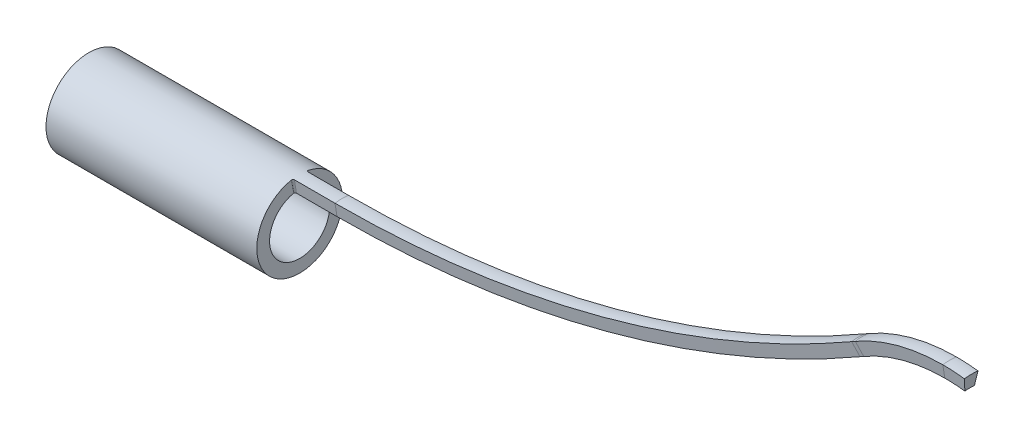
ISO-10303-21;
HEADER;
FILE_DESCRIPTION(('STEP AP214'),'2;1');
FILE_NAME('part.step','',(''),(''),'','','');
FILE_SCHEMA(('AUTOMOTIVE_DESIGN { 1 0 10303 214 1 1 1 1 }'));
ENDSEC;
DATA;
#1=APPLICATION_CONTEXT('core data for automotive mechanical design processes');
#2=APPLICATION_PROTOCOL_DEFINITION('international standard','automotive_design',2000,#1);
#3=PRODUCT_CONTEXT('',#1,'mechanical');
#4=PRODUCT('Part','Part','',(#3));
#5=PRODUCT_RELATED_PRODUCT_CATEGORY('part','',(#4));
#6=PRODUCT_DEFINITION_FORMATION('','',#4);
#7=PRODUCT_DEFINITION_CONTEXT('part definition',#1,'design');
#8=PRODUCT_DEFINITION('design','',#6,#7);
#9=PRODUCT_DEFINITION_SHAPE('','',#8);
#10=(LENGTH_UNIT() NAMED_UNIT(*) SI_UNIT(.MILLI.,.METRE.));
#11=(NAMED_UNIT(*) PLANE_ANGLE_UNIT() SI_UNIT($,.RADIAN.));
#12=(NAMED_UNIT(*) SI_UNIT($,.STERADIAN.) SOLID_ANGLE_UNIT());
#13=UNCERTAINTY_MEASURE_WITH_UNIT(LENGTH_MEASURE(1.E-05),#10,'distance_accuracy_value','');
#14=(GEOMETRIC_REPRESENTATION_CONTEXT(3) GLOBAL_UNCERTAINTY_ASSIGNED_CONTEXT((#13)) GLOBAL_UNIT_ASSIGNED_CONTEXT((#10,
#11,#12)) REPRESENTATION_CONTEXT('',''));
#15=CARTESIAN_POINT('',(0.,0.,0.));
#16=DIRECTION('',(0.,0.,1.));
#17=DIRECTION('',(1.,0.,0.));
#18=AXIS2_PLACEMENT_3D('',#15,#16,#17);
#19=CARTESIAN_POINT('',(49.,0.,0.));
#20=DIRECTION('',(-1.,0.,0.));
#21=DIRECTION('',(0.,-0.83146961230255,-0.555570233019595));
#22=AXIS2_PLACEMENT_3D('',#19,#20,#21);
#23=CYLINDRICAL_SURFACE('',#22,1.016);
#24=CARTESIAN_POINT('',(0.,0.,0.));
#25=DIRECTION('',(-1.,0.,0.));
#26=DIRECTION('',(0.,-0.92387953251129,-0.382683432365081));
#27=AXIS2_PLACEMENT_3D('',#24,#25,#26);
#28=CIRCLE('',#27,1.016);
#29=CARTESIAN_POINT('',(0.,-0.938661605031471,-0.388806367282923));
#30=VERTEX_POINT('',#29);
#31=EDGE_CURVE('E179',#30,#30,#28,.T.);
#32=ORIENTED_EDGE('',*,*,#31,.F.);
#33=EDGE_LOOP('',(#32));
#34=FACE_BOUND('',#33,.T.);
#35=CARTESIAN_POINT('',(4.99999999999999,0.996477844889681,-0.198211767168391));
#36=CARTESIAN_POINT('',(5.00173146233309,1.00082687806446,-0.176347700936244));
#37=CARTESIAN_POINT('',(5.01520552936779,1.00287171036555,-0.162808629501926));
#38=CARTESIAN_POINT('',(5.03749999999998,1.00311339347271,-0.161305672050498));
#39=B_SPLINE_CURVE_WITH_KNOTS('',3,(#35,#36,#37,#38),.UNSPECIFIED.,.F.,.F.,(4,4),(0.,1.),.UNSPECIFIED.);
#40=CARTESIAN_POINT('',(5.,0.996477844889681,-0.198211767168391));
#41=VERTEX_POINT('',#40);
#42=CARTESIAN_POINT('',(5.03749999999998,1.00311339347271,-0.161305672050498));
#43=VERTEX_POINT('',#42);
#44=EDGE_CURVE('E289',#41,#43,#39,.T.);
#45=ORIENTED_EDGE('',*,*,#44,.F.);
#46=CARTESIAN_POINT('',(5.,0.,0.));
#47=DIRECTION('',(1.,0.,0.));
#48=DIRECTION('',(0.,-0.195090322016129,-0.98078528040323));
#49=AXIS2_PLACEMENT_3D('',#46,#47,#48);
#50=CIRCLE('',#49,1.016);
#51=CARTESIAN_POINT('',(5.,0.996477844889683,0.198211767168382));
#52=VERTEX_POINT('',#51);
#53=EDGE_CURVE('E84',#52,#41,#50,.T.);
#54=ORIENTED_EDGE('',*,*,#53,.F.);
#55=CARTESIAN_POINT('',(5.03749999999998,1.00311339347271,0.16130567205049));
#56=CARTESIAN_POINT('',(5.01520552936779,1.00287171036555,0.162808629501918));
#57=CARTESIAN_POINT('',(5.00173146233309,1.00082687806446,0.176347700936236));
#58=CARTESIAN_POINT('',(4.99999999999999,0.996477844889682,0.198211767168383));
#59=B_SPLINE_CURVE_WITH_KNOTS('',3,(#55,#56,#57,#58),.UNSPECIFIED.,.F.,.F.,(4,4),(0.,1.),.UNSPECIFIED.);
#60=CARTESIAN_POINT('',(5.03749999999998,1.00311339347271,0.16130567205049));
#61=VERTEX_POINT('',#60);
#62=EDGE_CURVE('E185',#52,#61,#59,.F.);
#63=ORIENTED_EDGE('',*,*,#62,.T.);
#64=DIRECTION('',(1.,0.,0.));
#65=VECTOR('',#64,1.);
#66=CARTESIAN_POINT('',(5.03749999999998,1.00311339347271,0.161305672050479));
#67=LINE('',#66,#65);
#68=CARTESIAN_POINT('',(6.,1.00311339347271,0.161305672050479));
#69=VERTEX_POINT('',#68);
#70=EDGE_CURVE('E253',#61,#69,#67,.T.);
#71=ORIENTED_EDGE('',*,*,#70,.T.);
#72=CARTESIAN_POINT('',(6.,0.,0.));
#73=DIRECTION('',(-1.,0.,0.));
#74=DIRECTION('',(0.,1.,0.));
#75=AXIS2_PLACEMENT_3D('',#72,#73,#74);
#76=CIRCLE('',#75,1.016);
#77=CARTESIAN_POINT('',(6.,1.00311339347271,-0.161305672050487));
#78=VERTEX_POINT('',#77);
#79=EDGE_CURVE('E271',#69,#78,#76,.T.);
#80=ORIENTED_EDGE('',*,*,#79,.T.);
#81=DIRECTION('',(1.,0.,0.));
#82=VECTOR('',#81,1.);
#83=CARTESIAN_POINT('',(5.03749999999998,1.00311339347271,-0.161305672050487));
#84=LINE('',#83,#82);
#85=EDGE_CURVE('E257',#43,#78,#84,.T.);
#86=ORIENTED_EDGE('',*,*,#85,.F.);
#87=EDGE_LOOP('',(#45,#54,#63,#71,#80,#86));
#88=FACE_BOUND('',#87,.T.);
#89=ADVANCED_FACE('F74',(#34,#88),#23,.T.);
#90=CARTESIAN_POINT('',(49.,0.,0.));
#91=DIRECTION('',(-1.,0.,0.));
#92=DIRECTION('',(0.,-0.83146961230255,-0.555570233019595));
#93=AXIS2_PLACEMENT_3D('',#90,#91,#92);
#94=CYLINDRICAL_SURFACE('',#93,0.71305);
#95=CARTESIAN_POINT('',(0.,0.,0.));
#96=DIRECTION('',(1.,0.,0.));
#97=DIRECTION('',(0.,0.83146961230255,0.555570233019595));
#98=AXIS2_PLACEMENT_3D('',#95,#96,#97);
#99=CIRCLE('',#98,0.71305);
#100=CARTESIAN_POINT('',(0.,0.592879407052334,0.396149354654622));
#101=VERTEX_POINT('',#100);
#102=EDGE_CURVE('E268',#101,#101,#99,.F.);
#103=ORIENTED_EDGE('',*,*,#102,.T.);
#104=EDGE_LOOP('',(#103));
#105=FACE_BOUND('',#104,.T.);
#106=CARTESIAN_POINT('',(5.,0.,0.));
#107=DIRECTION('',(-1.,0.,0.));
#108=DIRECTION('',(0.,0.195090322016129,0.98078528040323));
#109=AXIS2_PLACEMENT_3D('',#106,#107,#108);
#110=CIRCLE('',#109,0.71305);
#111=CARTESIAN_POINT('',(5.,0.699348944191523,-0.139109154113604));
#112=VERTEX_POINT('',#111);
#113=CARTESIAN_POINT('',(5.,0.699348944191524,0.139109154113598));
#114=VERTEX_POINT('',#113);
#115=EDGE_CURVE('E91',#112,#114,#110,.T.);
#116=ORIENTED_EDGE('',*,*,#115,.F.);
#117=CARTESIAN_POINT('',(5.03749999999998,0.70400591064539,-0.113207686472055));
#118=CARTESIAN_POINT('',(5.03413677933053,0.703977045503818,-0.113380133199832));
#119=CARTESIAN_POINT('',(5.03074195452773,0.703921259299377,-0.113732606192146));
#120=CARTESIAN_POINT('',(5.02399800070892,0.703713418369976,-0.11501583253725));
#121=CARTESIAN_POINT('',(5.02065140437002,0.70355932900066,-0.115958799946374));
#122=CARTESIAN_POINT('',(5.01447804216707,0.703124622340713,-0.118565142588096));
#123=CARTESIAN_POINT('',(5.01163167477518,0.702852799093418,-0.120178174880666));
#124=CARTESIAN_POINT('',(5.00662328198196,0.702133683745613,-0.124309432669281));
#125=CARTESIAN_POINT('',(5.00446706325751,0.701684970216392,-0.126834976716172));
#126=CARTESIAN_POINT('',(5.0015465208688,0.700695869158151,-0.132181179109899));
#127=CARTESIAN_POINT('',(5.00064805774704,0.700172528939697,-0.134931929968751));
#128=CARTESIAN_POINT('',(5.00011504407252,0.699532168875911,-0.138185752944707));
#129=CARTESIAN_POINT('',(5.00005159955038,0.699440840556795,-0.138647327385374));
#130=CARTESIAN_POINT('',(4.99999999999863,0.699348944189372,-0.139109154125748));
#131=B_SPLINE_CURVE_WITH_KNOTS('',3,(#117,#118,#119,#120,#121,#122,#123,#124,#125,#126,#127,
#128,#129,#130),.UNSPECIFIED.,.F.,.F.,(4,2,2,2,2,2,4),(0.,0.0101624557859378,0.0205423930906358,
0.030253395764986,0.0400440775833152,0.048680356512646,0.050103807229662),.UNSPECIFIED.);
#132=CARTESIAN_POINT('',(5.03749999999998,0.70400591064539,-0.113207686472055));
#133=VERTEX_POINT('',#132);
#134=EDGE_CURVE('E386',#133,#112,#131,.T.);
#135=ORIENTED_EDGE('',*,*,#134,.F.);
#136=DIRECTION('',(-1.,0.,0.));
#137=VECTOR('',#136,1.);
#138=CARTESIAN_POINT('',(49.,0.704005910645391,-0.113207686472047));
#139=LINE('',#138,#137);
#140=CARTESIAN_POINT('',(6.,0.704005910645391,-0.113207686472047));
#141=VERTEX_POINT('',#140);
#142=EDGE_CURVE('E255',#141,#133,#139,.T.);
#143=ORIENTED_EDGE('',*,*,#142,.F.);
#144=CARTESIAN_POINT('',(6.,0.,0.));
#145=DIRECTION('',(1.,0.,0.));
#146=DIRECTION('',(0.,-0.980785280403231,-0.195090322016125));
#147=AXIS2_PLACEMENT_3D('',#144,#145,#146);
#148=CIRCLE('',#147,0.71305);
#149=CARTESIAN_POINT('',(6.,0.704005910645392,0.113207686472042));
#150=VERTEX_POINT('',#149);
#151=EDGE_CURVE('E270',#141,#150,#148,.T.);
#152=ORIENTED_EDGE('',*,*,#151,.T.);
#153=DIRECTION('',(-1.,0.,0.));
#154=VECTOR('',#153,1.);
#155=CARTESIAN_POINT('',(49.,0.704005910645392,0.113207686472042));
#156=LINE('',#155,#154);
#157=CARTESIAN_POINT('',(5.03749999999998,0.704005910645391,0.113207686472049));
#158=VERTEX_POINT('',#157);
#159=EDGE_CURVE('E175',#150,#158,#156,.T.);
#160=ORIENTED_EDGE('',*,*,#159,.T.);
#161=CARTESIAN_POINT('',(5.03749999999998,0.704005910645391,0.113207686472049));
#162=CARTESIAN_POINT('',(5.03413677933053,0.703977045503819,0.113380133199827));
#163=CARTESIAN_POINT('',(5.03074195452773,0.703921259299378,0.113732606192141));
#164=CARTESIAN_POINT('',(5.02399800070892,0.703713418369977,0.115015832537244));
#165=CARTESIAN_POINT('',(5.02065140437002,0.703559329000661,0.115958799946368));
#166=CARTESIAN_POINT('',(5.01447804216707,0.703124622340714,0.118565142588091));
#167=CARTESIAN_POINT('',(5.01163167477518,0.702852799093419,0.12017817488066));
#168=CARTESIAN_POINT('',(5.00662328198196,0.702133683745614,0.124309432669275));
#169=CARTESIAN_POINT('',(5.00446706325751,0.701684970216393,0.126834976716167));
#170=CARTESIAN_POINT('',(5.0015465208688,0.700695869158152,0.132181179109894));
#171=CARTESIAN_POINT('',(5.00064805774704,0.700172528939698,0.134931929968745));
#172=CARTESIAN_POINT('',(5.00011504407252,0.699532168875912,0.138185752944701));
#173=CARTESIAN_POINT('',(5.00005159955038,0.699440840556796,0.138647327385368));
#174=CARTESIAN_POINT('',(4.99999999999863,0.699348944189373,0.139109154125742));
#175=B_SPLINE_CURVE_WITH_KNOTS('',3,(#161,#162,#163,#164,#165,#166,#167,#168,#169,#170,#171,
#172,#173,#174),.UNSPECIFIED.,.F.,.F.,(4,2,2,2,2,2,4),(0.,0.0101624557859369,0.0205423930906358,
0.0302533957649859,0.0400440775833151,0.048680356512646,0.0501038072296619),.UNSPECIFIED.);
#176=EDGE_CURVE('E172',#158,#114,#175,.T.);
#177=ORIENTED_EDGE('',*,*,#176,.T.);
#178=EDGE_LOOP('',(#116,#135,#143,#152,#160,#177));
#179=FACE_BOUND('',#178,.T.);
#180=ADVANCED_FACE('F173',(#105,#179),#94,.F.);
#181=CARTESIAN_POINT('',(0.,0.,0.));
#182=DIRECTION('',(1.,0.,0.));
#183=DIRECTION('',(0.,0.83146961230255,0.555570233019595));
#184=AXIS2_PLACEMENT_3D('',#181,#182,#183);
#185=PLANE('',#184);
#186=ORIENTED_EDGE('',*,*,#102,.F.);
#187=EDGE_LOOP('',(#186));
#188=FACE_BOUND('',#187,.T.);
#189=ORIENTED_EDGE('',*,*,#31,.T.);
#190=EDGE_LOOP('',(#189));
#191=FACE_BOUND('',#190,.T.);
#192=ADVANCED_FACE('F500',(#188,#191),#185,.F.);
#193=CARTESIAN_POINT('',(5.51874999999999,1.00311339347271,0.161305672050479));
#194=DIRECTION('',(0.,-0.158765425246535,0.987316332158183));
#195=DIRECTION('',(1.,0.,0.));
#196=AXIS2_PLACEMENT_3D('',#193,#194,#195);
#197=PLANE('',#196);
#198=ORIENTED_EDGE('',*,*,#159,.F.);
#199=DIRECTION('',(0.,-0.987316332158183,-0.158765425246535));
#200=VECTOR('',#199,1.);
#201=CARTESIAN_POINT('',(6.,1.00311339347271,0.161305672050479));
#202=LINE('',#201,#200);
#203=EDGE_CURVE('E232',#69,#150,#202,.T.);
#204=ORIENTED_EDGE('',*,*,#203,.F.);
#205=ORIENTED_EDGE('',*,*,#70,.F.);
#206=CARTESIAN_POINT('',(5.03749999999998,0.410723594177803,0.0660464169025629));
#207=CARTESIAN_POINT('',(5.03749999999998,1.00311339347271,0.16130567205049));
#208=B_SPLINE_CURVE_WITH_KNOTS('',1,(#206,#207),.UNSPECIFIED.,.F.,.F.,(2,2),(0.,1.),.UNSPECIFIED.);
#209=EDGE_CURVE('E241',#61,#158,#208,.F.);
#210=ORIENTED_EDGE('',*,*,#209,.T.);
#211=EDGE_LOOP('',(#198,#204,#205,#210));
#212=FACE_BOUND('',#211,.T.);
#213=ADVANCED_FACE('F208',(#212),#197,.T.);
#214=CARTESIAN_POINT('',(4.99999999999999,0.996477844889682,0.198211767168383));
#215=CARTESIAN_POINT('',(5.00173146233309,1.00082687806446,0.176347700936236));
#216=CARTESIAN_POINT('',(5.01520552936779,1.00287171036555,0.162808629501918));
#217=CARTESIAN_POINT('',(5.03749999999998,1.00311339347271,0.16130567205049));
#218=CARTESIAN_POINT('',(4.99999999999999,0.408006676647744,0.081157573958708));
#219=CARTESIAN_POINT('',(5.00172880751255,0.409784652818756,0.0722190841381207));
#220=CARTESIAN_POINT('',(5.01520471292913,0.410624633691162,0.0666618235916894));
#221=CARTESIAN_POINT('',(5.03749999999998,0.410723594177803,0.0660464169025629));
#222=B_SPLINE_SURFACE_WITH_KNOTS('',1,3,((#214,#215,#216,#217),(#218,#219,#220,#221)),
.UNSPECIFIED.,.F.,.F.,.F.,(2,2),(4,4),(0.,1.),(0.,1.),.UNSPECIFIED.);
#223=CARTESIAN_POINT('',(4.99999999999999,0.996477844889682,0.198211767168383));
#224=CARTESIAN_POINT('',(4.99999999999999,0.408006676647744,0.081157573958708));
#225=B_SPLINE_CURVE_WITH_KNOTS('',1,(#223,#224),.UNSPECIFIED.,.F.,.F.,(2,2),(0.,1.),.UNSPECIFIED.);
#226=EDGE_CURVE('E163',#114,#52,#225,.F.);
#227=ORIENTED_EDGE('',*,*,#176,.F.);
#228=ORIENTED_EDGE('',*,*,#209,.F.);
#229=ORIENTED_EDGE('',*,*,#62,.F.);
#230=ORIENTED_EDGE('',*,*,#226,.F.);
#231=EDGE_LOOP('',(#227,#228,#229,#230));
#232=FACE_BOUND('',#231,.T.);
#233=ADVANCED_FACE('F183',(#232),#222,.T.);
#234=CARTESIAN_POINT('',(5.51874999999999,1.00311339347271,-0.161305672050487));
#235=DIRECTION('',(0.,-0.158765425246542,-0.987316332158181));
#236=DIRECTION('',(1.,0.,0.));
#237=AXIS2_PLACEMENT_3D('',#234,#235,#236);
#238=PLANE('',#237);
#239=ORIENTED_EDGE('',*,*,#142,.T.);
#240=CARTESIAN_POINT('',(5.03749999999998,1.00311339347271,-0.161305672050498));
#241=CARTESIAN_POINT('',(5.03749999999998,0.410723594177803,-0.0660464169025661));
#242=B_SPLINE_CURVE_WITH_KNOTS('',1,(#240,#241),.UNSPECIFIED.,.F.,.F.,(2,2),(0.,1.),.UNSPECIFIED.);
#243=EDGE_CURVE('E333',#43,#133,#242,.T.);
#244=ORIENTED_EDGE('',*,*,#243,.F.);
#245=ORIENTED_EDGE('',*,*,#85,.T.);
#246=DIRECTION('',(0.,-0.987316332158181,0.158765425246543));
#247=VECTOR('',#246,1.);
#248=CARTESIAN_POINT('',(6.,1.00311339347271,-0.161305672050487));
#249=LINE('',#248,#247);
#250=EDGE_CURVE('E388',#78,#141,#249,.T.);
#251=ORIENTED_EDGE('',*,*,#250,.T.);
#252=EDGE_LOOP('',(#239,#244,#245,#251));
#253=FACE_BOUND('',#252,.T.);
#254=ADVANCED_FACE('F207',(#253),#238,.T.);
#255=CARTESIAN_POINT('',(4.99999999999999,0.996477844889681,-0.198211767168391));
#256=CARTESIAN_POINT('',(5.00173146233309,1.00082687806446,-0.176347700936244));
#257=CARTESIAN_POINT('',(5.01520552936779,1.00287171036555,-0.162808629501926));
#258=CARTESIAN_POINT('',(5.03749999999998,1.00311339347271,-0.161305672050498));
#259=CARTESIAN_POINT('',(4.99999999999999,0.408006676647743,-0.0811575739587113));
#260=CARTESIAN_POINT('',(5.00172880751255,0.409784652818755,-0.0722190841381239));
#261=CARTESIAN_POINT('',(5.01520471292913,0.410624633691162,-0.0666618235916926));
#262=CARTESIAN_POINT('',(5.03749999999998,0.410723594177803,-0.0660464169025661));
#263=B_SPLINE_SURFACE_WITH_KNOTS('',1,3,((#255,#256,#257,#258),(#259,#260,#261,#262)),
.UNSPECIFIED.,.F.,.F.,.F.,(2,2),(4,4),(0.,1.),(0.,1.),.UNSPECIFIED.);
#264=CARTESIAN_POINT('',(4.99999999999999,0.408006676647743,-0.0811575739587113));
#265=CARTESIAN_POINT('',(4.99999999999999,0.996477844889681,-0.198211767168391));
#266=B_SPLINE_CURVE_WITH_KNOTS('',1,(#264,#265),.UNSPECIFIED.,.F.,.F.,(2,2),(0.,1.),.UNSPECIFIED.);
#267=EDGE_CURVE('E13',#41,#112,#266,.F.);
#268=ORIENTED_EDGE('',*,*,#134,.T.);
#269=ORIENTED_EDGE('',*,*,#267,.F.);
#270=ORIENTED_EDGE('',*,*,#44,.T.);
#271=ORIENTED_EDGE('',*,*,#243,.T.);
#272=EDGE_LOOP('',(#268,#269,#270,#271));
#273=FACE_BOUND('',#272,.T.);
#274=ADVANCED_FACE('F398',(#273),#263,.F.);
#275=CARTESIAN_POINT('',(20.8049197611685,3.86565794249141,0.));
#276=DIRECTION('',(0.99235517524992,-0.123414772838185,0.));
#277=DIRECTION('',(-0.121043392584,-0.97328734881709,-0.195090322016125));
#278=AXIS2_PLACEMENT_3D('',#275,#276,#277);
#279=PLANE('',#278);
#280=CARTESIAN_POINT('',(20.8049197611685,3.86565794249141,0.));
#281=DIRECTION('',(0.99235517524992,-0.123414772838185,0.));
#282=DIRECTION('',(-0.121043392584,-0.97328734881709,-0.195090322016125));
#283=AXIS2_PLACEMENT_3D('',#280,#281,#282);
#284=CIRCLE('',#283,1.016);
#285=CARTESIAN_POINT('',(20.9287187727549,4.86110270986657,-0.161305672050499));
#286=VERTEX_POINT('',#285);
#287=CARTESIAN_POINT('',(20.9287187727549,4.86110270986657,0.161305672050468));
#288=VERTEX_POINT('',#287);
#289=EDGE_CURVE('E330',#286,#288,#284,.T.);
#290=ORIENTED_EDGE('',*,*,#289,.T.);
#291=DIRECTION('',(-0.121849420852732,-0.979768471825941,-0.158765425246535));
#292=VECTOR('',#291,1.);
#293=CARTESIAN_POINT('',(20.9287187727549,4.86110270986657,0.161305672050468));
#294=LINE('',#293,#292);
#295=CARTESIAN_POINT('',(20.8918044907075,4.5642818513269,0.11320768647203));
#296=VERTEX_POINT('',#295);
#297=EDGE_CURVE('E332',#288,#296,#294,.T.);
#298=ORIENTED_EDGE('',*,*,#297,.T.);
#299=CARTESIAN_POINT('',(20.8049197611685,3.86565794249141,0.));
#300=DIRECTION('',(-0.99235517524992,0.123414772838185,0.));
#301=DIRECTION('',(-0.121043392584,-0.97328734881709,-0.195090322016125));
#302=AXIS2_PLACEMENT_3D('',#299,#300,#301);
#303=CIRCLE('',#302,0.71305);
#304=CARTESIAN_POINT('',(20.8918044907075,4.5642818513269,-0.113207686472059));
#305=VERTEX_POINT('',#304);
#306=EDGE_CURVE('E358',#296,#305,#303,.T.);
#307=ORIENTED_EDGE('',*,*,#306,.T.);
#308=DIRECTION('',(0.121849420852732,0.97976847182594,-0.158765425246543));
#309=VECTOR('',#308,1.);
#310=CARTESIAN_POINT('',(20.8918044907075,4.5642818513269,-0.113207686472059));
#311=LINE('',#310,#309);
#312=EDGE_CURVE('E303',#305,#286,#311,.T.);
#313=ORIENTED_EDGE('',*,*,#312,.T.);
#314=EDGE_LOOP('',(#290,#298,#307,#313));
#315=FACE_BOUND('',#314,.T.);
#316=ADVANCED_FACE('F403',(#315),#279,.T.);
#317=CARTESIAN_POINT('',(6.,25.513559652059,0.));
#318=DIRECTION('',(0.,0.,1.));
#319=DIRECTION('',(0.,-1.,0.));
#320=AXIS2_PLACEMENT_3D('',#317,#318,#319);
#321=TOROIDAL_SURFACE('',#320,25.513559652059,1.016);
#322=CARTESIAN_POINT('',(6.,25.513559652059,0.161305672050407));
#323=DIRECTION('',(0.,0.,1.));
#324=DIRECTION('',(0.,-1.,0.));
#325=AXIS2_PLACEMENT_3D('',#322,#323,#324);
#326=CIRCLE('',#325,24.5104462585863);
#327=CARTESIAN_POINT('',(18.2552231292932,4.28689053403004,0.16130567205047));
#328=VERTEX_POINT('',#327);
#329=EDGE_CURVE('E299',#69,#328,#326,.T.);
#330=ORIENTED_EDGE('',*,*,#329,.T.);
#331=CARTESIAN_POINT('',(18.7567798260295,3.41816885240626,0.));
#332=DIRECTION('',(0.866025403784438,0.500000000000001,0.));
#333=DIRECTION('',(0.490392640201617,-0.849384968487041,-0.195090322016126));
#334=AXIS2_PLACEMENT_3D('',#331,#332,#333);
#335=CIRCLE('',#334,1.016);
#336=CARTESIAN_POINT('',(18.2552231292932,4.28689053403004,-0.161305672050498));
#337=VERTEX_POINT('',#336);
#338=EDGE_CURVE('E293',#337,#328,#335,.T.);
#339=ORIENTED_EDGE('',*,*,#338,.F.);
#340=CARTESIAN_POINT('',(6.,25.513559652059,-0.161305672050561));
#341=DIRECTION('',(0.,0.,1.));
#342=DIRECTION('',(0.,-1.,0.));
#343=AXIS2_PLACEMENT_3D('',#340,#341,#342);
#344=CIRCLE('',#343,24.5104462585863);
#345=EDGE_CURVE('E304',#78,#337,#344,.T.);
#346=ORIENTED_EDGE('',*,*,#345,.F.);
#347=ORIENTED_EDGE('',*,*,#79,.F.);
#348=EDGE_LOOP('',(#330,#339,#346,#347));
#349=FACE_BOUND('',#348,.T.);
#350=ADVANCED_FACE('F454',(#349),#321,.T.);
#351=CARTESIAN_POINT('',(6.,25.513559652059,0.161305672050407));
#352=DIRECTION('',(0.,0.,-1.));
#353=DIRECTION('',(0.,1.,0.));
#354=AXIS2_PLACEMENT_3D('',#351,#352,#353);
#355=CONICAL_SURFACE('',#354,24.5104462585863,1.41135623476443);
#356=CARTESIAN_POINT('',(6.,25.513559652059,0.113207686471968));
#357=DIRECTION('',(0.,0.,1.));
#358=DIRECTION('',(0.,-1.,0.));
#359=AXIS2_PLACEMENT_3D('',#356,#357,#358);
#360=CIRCLE('',#359,24.8095537414136);
#361=CARTESIAN_POINT('',(18.4047768707068,4.02785585543957,0.113207686472032));
#362=VERTEX_POINT('',#361);
#363=EDGE_CURVE('E302',#150,#362,#360,.T.);
#364=ORIENTED_EDGE('',*,*,#363,.T.);
#365=DIRECTION('',(0.493658166079092,-0.85504102522026,-0.158765425246536));
#366=VECTOR('',#365,1.);
#367=CARTESIAN_POINT('',(18.2552231292932,4.28689053403005,0.16130567205047));
#368=LINE('',#367,#366);
#369=EDGE_CURVE('E339',#328,#362,#368,.T.);
#370=ORIENTED_EDGE('',*,*,#369,.F.);
#371=ORIENTED_EDGE('',*,*,#329,.F.);
#372=ORIENTED_EDGE('',*,*,#203,.T.);
#373=EDGE_LOOP('',(#364,#370,#371,#372));
#374=FACE_BOUND('',#373,.T.);
#375=ADVANCED_FACE('F491',(#374),#355,.T.);
#376=CARTESIAN_POINT('',(6.,25.513559652059,0.));
#377=DIRECTION('',(0.,0.,1.));
#378=DIRECTION('',(0.,-1.,0.));
#379=AXIS2_PLACEMENT_3D('',#376,#377,#378);
#380=TOROIDAL_SURFACE('',#379,25.513559652059,0.71305);
#381=CARTESIAN_POINT('',(6.,25.513559652059,-0.113207686472123));
#382=DIRECTION('',(0.,0.,1.));
#383=DIRECTION('',(0.,-1.,0.));
#384=AXIS2_PLACEMENT_3D('',#381,#382,#383);
#385=CIRCLE('',#384,24.8095537414136);
#386=CARTESIAN_POINT('',(18.4047768707068,4.02785585543957,-0.113207686472058));
#387=VERTEX_POINT('',#386);
#388=EDGE_CURVE('E307',#141,#387,#385,.T.);
#389=ORIENTED_EDGE('',*,*,#388,.T.);
#390=CARTESIAN_POINT('',(18.7567798260295,3.41816885240626,0.));
#391=DIRECTION('',(-0.866025403784438,-0.500000000000001,0.));
#392=DIRECTION('',(0.490392640201617,-0.849384968487041,-0.195090322016126));
#393=AXIS2_PLACEMENT_3D('',#390,#391,#392);
#394=CIRCLE('',#393,0.71305);
#395=EDGE_CURVE('E361',#362,#387,#394,.T.);
#396=ORIENTED_EDGE('',*,*,#395,.F.);
#397=ORIENTED_EDGE('',*,*,#363,.F.);
#398=ORIENTED_EDGE('',*,*,#151,.F.);
#399=EDGE_LOOP('',(#389,#396,#397,#398));
#400=FACE_BOUND('',#399,.T.);
#401=ADVANCED_FACE('F445',(#400),#380,.F.);
#402=CARTESIAN_POINT('',(6.,25.513559652059,-0.113207686472123));
#403=DIRECTION('',(0.,0.,1.));
#404=DIRECTION('',(0.,-1.,0.));
#405=AXIS2_PLACEMENT_3D('',#402,#403,#404);
#406=CONICAL_SURFACE('',#405,24.8095537414136,1.41135623476443);
#407=DIRECTION('',(-0.493658166079092,0.855041025220259,-0.158765425246542));
#408=VECTOR('',#407,1.);
#409=CARTESIAN_POINT('',(18.4047768707068,4.02785585543957,-0.113207686472057));
#410=LINE('',#409,#408);
#411=EDGE_CURVE('E318',#387,#337,#410,.T.);
#412=ORIENTED_EDGE('',*,*,#411,.F.);
#413=ORIENTED_EDGE('',*,*,#388,.F.);
#414=ORIENTED_EDGE('',*,*,#250,.F.);
#415=ORIENTED_EDGE('',*,*,#345,.T.);
#416=EDGE_LOOP('',(#412,#413,#414,#415));
#417=FACE_BOUND('',#416,.T.);
#418=ADVANCED_FACE('F448',(#417),#406,.T.);
#419=CARTESIAN_POINT('',(18.7567798260295,3.41816885240626,0.));
#420=DIRECTION('',(0.86602540378443,0.500000000000015,0.));
#421=DIRECTION('',(0.492742480023374,-0.853455010447942,-0.169762756580228));
#422=AXIS2_PLACEMENT_3D('',#419,#420,#421);
#423=CYLINDRICAL_SURFACE('',#422,1.016);
#424=DIRECTION('',(0.86602540378443,0.500000000000015,0.));
#425=VECTOR('',#424,1.);
#426=CARTESIAN_POINT('',(18.2552231292932,4.28689053403004,0.16130567205047));
#427=LINE('',#426,#425);
#428=CARTESIAN_POINT('',(18.3418256696716,4.33689053403004,0.16130567205047));
#429=VERTEX_POINT('',#428);
#430=EDGE_CURVE('E298',#328,#429,#427,.T.);
#431=ORIENTED_EDGE('',*,*,#430,.T.);
#432=CARTESIAN_POINT('',(18.843382366408,3.46816885240627,0.));
#433=DIRECTION('',(0.86602540378443,0.500000000000015,0.));
#434=DIRECTION('',(0.49039264020163,-0.849384968487033,-0.195090322016126));
#435=AXIS2_PLACEMENT_3D('',#432,#433,#434);
#436=CIRCLE('',#435,1.016);
#437=CARTESIAN_POINT('',(18.3418256696716,4.33689053403004,-0.161305672050497));
#438=VERTEX_POINT('',#437);
#439=EDGE_CURVE('E308',#438,#429,#436,.T.);
#440=ORIENTED_EDGE('',*,*,#439,.F.);
#441=DIRECTION('',(0.86602540378443,0.500000000000015,0.));
#442=VECTOR('',#441,1.);
#443=CARTESIAN_POINT('',(18.2552231292932,4.28689053403004,-0.161305672050497));
#444=LINE('',#443,#442);
#445=EDGE_CURVE('E315',#337,#438,#444,.T.);
#446=ORIENTED_EDGE('',*,*,#445,.F.);
#447=ORIENTED_EDGE('',*,*,#338,.T.);
#448=EDGE_LOOP('',(#431,#440,#446,#447));
#449=FACE_BOUND('',#448,.T.);
#450=ADVANCED_FACE('F457',(#449),#423,.T.);
#451=CARTESIAN_POINT('',(18.2552231292932,4.28689053403004,0.16130567205047));
#452=DIRECTION('',(0.0793827126232703,-0.137494891506138,0.987316332158183));
#453=DIRECTION('',(0.996833631496033,0.0155127000572294,-0.0779876096272133));
#454=AXIS2_PLACEMENT_3D('',#451,#452,#453);
#455=PLANE('',#454);
#456=DIRECTION('',(0.86602540378443,0.500000000000015,0.));
#457=VECTOR('',#456,1.);
#458=CARTESIAN_POINT('',(18.4047768707068,4.02785585543956,0.113207686472032));
#459=LINE('',#458,#457);
#460=CARTESIAN_POINT('',(18.4913794110853,4.07785585543957,0.113207686472032));
#461=VERTEX_POINT('',#460);
#462=EDGE_CURVE('E297',#362,#461,#459,.T.);
#463=ORIENTED_EDGE('',*,*,#462,.T.);
#464=DIRECTION('',(0.493658166079106,-0.855041025220252,-0.158765425246536));
#465=VECTOR('',#464,1.);
#466=CARTESIAN_POINT('',(18.3418256696716,4.33689053403004,0.16130567205047));
#467=LINE('',#466,#465);
#468=EDGE_CURVE('E345',#429,#461,#467,.T.);
#469=ORIENTED_EDGE('',*,*,#468,.F.);
#470=ORIENTED_EDGE('',*,*,#430,.F.);
#471=ORIENTED_EDGE('',*,*,#369,.T.);
#472=EDGE_LOOP('',(#463,#469,#470,#471));
#473=FACE_BOUND('',#472,.T.);
#474=ADVANCED_FACE('F607',(#473),#455,.T.);
#475=CARTESIAN_POINT('',(18.7567798260295,3.41816885240626,0.));
#476=DIRECTION('',(0.86602540378443,0.500000000000015,0.));
#477=DIRECTION('',(0.492742480023374,-0.853455010447942,-0.169762756580228));
#478=AXIS2_PLACEMENT_3D('',#475,#476,#477);
#479=CYLINDRICAL_SURFACE('',#478,0.71305);
#480=DIRECTION('',(0.86602540378443,0.500000000000015,0.));
#481=VECTOR('',#480,1.);
#482=CARTESIAN_POINT('',(18.4047768707068,4.02785585543957,-0.113207686472057));
#483=LINE('',#482,#481);
#484=CARTESIAN_POINT('',(18.4913794110853,4.07785585543957,-0.113207686472057));
#485=VERTEX_POINT('',#484);
#486=EDGE_CURVE('E342',#387,#485,#483,.T.);
#487=ORIENTED_EDGE('',*,*,#486,.T.);
#488=CARTESIAN_POINT('',(18.843382366408,3.46816885240627,0.));
#489=DIRECTION('',(-0.86602540378443,-0.500000000000015,0.));
#490=DIRECTION('',(0.49039264020163,-0.849384968487033,-0.195090322016126));
#491=AXIS2_PLACEMENT_3D('',#488,#489,#490);
#492=CIRCLE('',#491,0.71305);
#493=EDGE_CURVE('E366',#461,#485,#492,.T.);
#494=ORIENTED_EDGE('',*,*,#493,.F.);
#495=ORIENTED_EDGE('',*,*,#462,.F.);
#496=ORIENTED_EDGE('',*,*,#395,.T.);
#497=EDGE_LOOP('',(#487,#494,#495,#496));
#498=FACE_BOUND('',#497,.T.);
#499=ADVANCED_FACE('F467',(#498),#479,.F.);
#500=CARTESIAN_POINT('',(18.4047768707068,4.02785585543957,-0.113207686472057));
#501=DIRECTION('',(0.0793827126232734,-0.137494891506144,-0.987316332158181));
#502=DIRECTION('',(0.,0.990441956034623,-0.137930169746544));
#503=AXIS2_PLACEMENT_3D('',#500,#501,#502);
#504=PLANE('',#503);
#505=DIRECTION('',(-0.493658166079105,0.855041025220251,-0.158765425246542));
#506=VECTOR('',#505,1.);
#507=CARTESIAN_POINT('',(18.4913794110853,4.07785585543957,-0.113207686472057));
#508=LINE('',#507,#506);
#509=EDGE_CURVE('E329',#485,#438,#508,.T.);
#510=ORIENTED_EDGE('',*,*,#509,.F.);
#511=ORIENTED_EDGE('',*,*,#486,.F.);
#512=ORIENTED_EDGE('',*,*,#411,.T.);
#513=ORIENTED_EDGE('',*,*,#445,.T.);
#514=EDGE_LOOP('',(#510,#511,#512,#513));
#515=FACE_BOUND('',#514,.T.);
#516=ADVANCED_FACE('F452',(#515),#504,.T.);
#517=CARTESIAN_POINT('',(20.4166025403784,0.743271579597054,0.));
#518=DIRECTION('',(0.,0.,-1.));
#519=DIRECTION('',(0.,1.,0.));
#520=AXIS2_PLACEMENT_3D('',#517,#518,#519);
#521=TOROIDAL_SURFACE('',#520,3.14644034794095,1.016);
#522=CARTESIAN_POINT('',(20.4166025403784,0.743271579597054,0.16130567205048));
#523=DIRECTION('',(0.,0.,-1.));
#524=DIRECTION('',(-0.500000000000002,0.866025403784437,0.));
#525=AXIS2_PLACEMENT_3D('',#522,#523,#524);
#526=CIRCLE('',#525,4.14955374141366);
#527=CARTESIAN_POINT('',(20.4166025403784,4.89282532101072,0.161305672050468));
#528=VERTEX_POINT('',#527);
#529=EDGE_CURVE('E312',#429,#528,#526,.T.);
#530=ORIENTED_EDGE('',*,*,#529,.T.);
#531=CARTESIAN_POINT('',(20.4166025403784,3.889711927538,0.));
#532=DIRECTION('',(1.,0.,0.));
#533=DIRECTION('',(0.,-0.980785280403231,-0.195090322016125));
#534=AXIS2_PLACEMENT_3D('',#531,#532,#533);
#535=CIRCLE('',#534,1.016);
#536=CARTESIAN_POINT('',(20.4166025403784,4.89282532101071,-0.161305672050499));
#537=VERTEX_POINT('',#536);
#538=EDGE_CURVE('E319',#537,#528,#535,.T.);
#539=ORIENTED_EDGE('',*,*,#538,.F.);
#540=CARTESIAN_POINT('',(20.4166025403784,0.743271579597053,-0.161305672050487));
#541=DIRECTION('',(0.,0.,-1.));
#542=DIRECTION('',(-0.500000000000002,0.866025403784437,0.));
#543=AXIS2_PLACEMENT_3D('',#540,#541,#542);
#544=CIRCLE('',#543,4.14955374141366);
#545=EDGE_CURVE('E326',#438,#537,#544,.T.);
#546=ORIENTED_EDGE('',*,*,#545,.F.);
#547=ORIENTED_EDGE('',*,*,#439,.T.);
#548=EDGE_LOOP('',(#530,#539,#546,#547));
#549=FACE_BOUND('',#548,.T.);
#550=ADVANCED_FACE('F460',(#549),#521,.T.);
#551=CARTESIAN_POINT('',(20.4166025403784,0.743271579597054,0.16130567205048));
#552=DIRECTION('',(0.,0.,1.));
#553=DIRECTION('',(0.,-1.,0.));
#554=AXIS2_PLACEMENT_3D('',#551,#552,#553);
#555=CONICAL_SURFACE('',#554,4.14955374141366,1.41135623476443);
#556=CARTESIAN_POINT('',(20.4166025403784,0.743271579597054,0.113207686472042));
#557=DIRECTION('',(0.,0.,-1.));
#558=DIRECTION('',(-0.500000000000001,0.866025403784438,0.));
#559=AXIS2_PLACEMENT_3D('',#556,#557,#558);
#560=CIRCLE('',#559,3.85044625858634);
#561=CARTESIAN_POINT('',(20.4166025403784,4.59371783818339,0.113207686472031));
#562=VERTEX_POINT('',#561);
#563=EDGE_CURVE('E311',#461,#562,#560,.T.);
#564=ORIENTED_EDGE('',*,*,#563,.T.);
#565=DIRECTION('',(0.,-0.987316332158182,-0.158765425246535));
#566=VECTOR('',#565,1.);
#567=CARTESIAN_POINT('',(20.4166025403784,4.89282532101071,0.161305672050468));
#568=LINE('',#567,#566);
#569=EDGE_CURVE('E351',#528,#562,#568,.T.);
#570=ORIENTED_EDGE('',*,*,#569,.F.);
#571=ORIENTED_EDGE('',*,*,#529,.F.);
#572=ORIENTED_EDGE('',*,*,#468,.T.);
#573=EDGE_LOOP('',(#564,#570,#571,#572));
#574=FACE_BOUND('',#573,.T.);
#575=ADVANCED_FACE('F473',(#574),#555,.F.);
#576=CARTESIAN_POINT('',(20.4166025403784,0.743271579597054,0.));
#577=DIRECTION('',(0.,0.,-1.));
#578=DIRECTION('',(0.,1.,0.));
#579=AXIS2_PLACEMENT_3D('',#576,#577,#578);
#580=TOROIDAL_SURFACE('',#579,3.14644034794095,0.71305);
#581=CARTESIAN_POINT('',(20.4166025403784,0.743271579597053,-0.113207686472048));
#582=DIRECTION('',(0.,0.,-1.));
#583=DIRECTION('',(-0.500000000000002,0.866025403784437,0.));
#584=AXIS2_PLACEMENT_3D('',#581,#582,#583);
#585=CIRCLE('',#584,3.85044625858634);
#586=CARTESIAN_POINT('',(20.4166025403784,4.59371783818339,-0.113207686472059));
#587=VERTEX_POINT('',#586);
#588=EDGE_CURVE('E348',#485,#587,#585,.T.);
#589=ORIENTED_EDGE('',*,*,#588,.T.);
#590=CARTESIAN_POINT('',(20.4166025403784,3.889711927538,0.));
#591=DIRECTION('',(-1.,0.,0.));
#592=DIRECTION('',(0.,-0.980785280403231,-0.195090322016125));
#593=AXIS2_PLACEMENT_3D('',#590,#591,#592);
#594=CIRCLE('',#593,0.71305);
#595=EDGE_CURVE('E371',#562,#587,#594,.T.);
#596=ORIENTED_EDGE('',*,*,#595,.F.);
#597=ORIENTED_EDGE('',*,*,#563,.F.);
#598=ORIENTED_EDGE('',*,*,#493,.T.);
#599=EDGE_LOOP('',(#589,#596,#597,#598));
#600=FACE_BOUND('',#599,.T.);
#601=ADVANCED_FACE('F469',(#600),#580,.F.);
#602=CARTESIAN_POINT('',(20.4166025403784,0.743271579597053,-0.113207686472048));
#603=DIRECTION('',(0.,0.,-1.));
#604=DIRECTION('',(0.,1.,0.));
#605=AXIS2_PLACEMENT_3D('',#602,#603,#604);
#606=CONICAL_SURFACE('',#605,3.85044625858634,1.41135623476443);
#607=DIRECTION('',(0.,0.987316332158181,-0.158765425246543));
#608=VECTOR('',#607,1.);
#609=CARTESIAN_POINT('',(20.4166025403784,4.59371783818339,-0.113207686472059));
#610=LINE('',#609,#608);
#611=EDGE_CURVE('E338',#587,#537,#610,.T.);
#612=ORIENTED_EDGE('',*,*,#611,.F.);
#613=ORIENTED_EDGE('',*,*,#588,.F.);
#614=ORIENTED_EDGE('',*,*,#509,.T.);
#615=ORIENTED_EDGE('',*,*,#545,.T.);
#616=EDGE_LOOP('',(#612,#613,#614,#615));
#617=FACE_BOUND('',#616,.T.);
#618=ADVANCED_FACE('F464',(#617),#606,.F.);
#619=CARTESIAN_POINT('',(20.4166025403784,0.743271579597054,0.));
#620=DIRECTION('',(0.,0.,-1.));
#621=DIRECTION('',(0.,1.,0.));
#622=AXIS2_PLACEMENT_3D('',#619,#620,#621);
#623=TOROIDAL_SURFACE('',#622,3.14644034794095,1.016);
#624=CARTESIAN_POINT('',(20.4166025403784,0.743271579597054,0.16130567205048));
#625=DIRECTION('',(0.,0.,-1.));
#626=DIRECTION('',(0.,1.,0.));
#627=AXIS2_PLACEMENT_3D('',#624,#625,#626);
#628=CIRCLE('',#627,4.14955374141366);
#629=EDGE_CURVE('E323',#528,#288,#628,.T.);
#630=ORIENTED_EDGE('',*,*,#629,.T.);
#631=ORIENTED_EDGE('',*,*,#289,.F.);
#632=CARTESIAN_POINT('',(20.4166025403784,0.743271579597053,-0.161305672050487));
#633=DIRECTION('',(0.,0.,-1.));
#634=DIRECTION('',(0.,1.,0.));
#635=AXIS2_PLACEMENT_3D('',#632,#633,#634);
#636=CIRCLE('',#635,4.14955374141366);
#637=EDGE_CURVE('E168',#537,#286,#636,.T.);
#638=ORIENTED_EDGE('',*,*,#637,.F.);
#639=ORIENTED_EDGE('',*,*,#538,.T.);
#640=EDGE_LOOP('',(#630,#631,#638,#639));
#641=FACE_BOUND('',#640,.T.);
#642=ADVANCED_FACE('F480',(#641),#623,.T.);
#643=CARTESIAN_POINT('',(20.4166025403784,0.743271579597054,0.16130567205048));
#644=DIRECTION('',(0.,0.,1.));
#645=DIRECTION('',(0.,-1.,0.));
#646=AXIS2_PLACEMENT_3D('',#643,#644,#645);
#647=CONICAL_SURFACE('',#646,4.14955374141366,1.41135623476443);
#648=CARTESIAN_POINT('',(20.4166025403784,0.743271579597054,0.113207686472042));
#649=DIRECTION('',(0.,0.,-1.));
#650=DIRECTION('',(0.,1.,0.));
#651=AXIS2_PLACEMENT_3D('',#648,#649,#650);
#652=CIRCLE('',#651,3.85044625858634);
#653=EDGE_CURVE('E322',#562,#296,#652,.T.);
#654=ORIENTED_EDGE('',*,*,#653,.T.);
#655=ORIENTED_EDGE('',*,*,#297,.F.);
#656=ORIENTED_EDGE('',*,*,#629,.F.);
#657=ORIENTED_EDGE('',*,*,#569,.T.);
#658=EDGE_LOOP('',(#654,#655,#656,#657));
#659=FACE_BOUND('',#658,.T.);
#660=ADVANCED_FACE('F476',(#659),#647,.F.);
#661=CARTESIAN_POINT('',(20.4166025403784,0.743271579597054,0.));
#662=DIRECTION('',(0.,0.,-1.));
#663=DIRECTION('',(0.,1.,0.));
#664=AXIS2_PLACEMENT_3D('',#661,#662,#663);
#665=TOROIDAL_SURFACE('',#664,3.14644034794095,0.71305);
#666=CARTESIAN_POINT('',(20.4166025403784,0.743271579597053,-0.113207686472048));
#667=DIRECTION('',(0.,0.,-1.));
#668=DIRECTION('',(0.,1.,0.));
#669=AXIS2_PLACEMENT_3D('',#666,#667,#668);
#670=CIRCLE('',#669,3.85044625858634);
#671=EDGE_CURVE('E354',#587,#305,#670,.T.);
#672=ORIENTED_EDGE('',*,*,#671,.T.);
#673=ORIENTED_EDGE('',*,*,#306,.F.);
#674=ORIENTED_EDGE('',*,*,#653,.F.);
#675=ORIENTED_EDGE('',*,*,#595,.T.);
#676=EDGE_LOOP('',(#672,#673,#674,#675));
#677=FACE_BOUND('',#676,.T.);
#678=ADVANCED_FACE('F485',(#677),#665,.F.);
#679=CARTESIAN_POINT('',(20.4166025403784,0.743271579597053,-0.113207686472048));
#680=DIRECTION('',(0.,0.,-1.));
#681=DIRECTION('',(0.,1.,0.));
#682=AXIS2_PLACEMENT_3D('',#679,#680,#681);
#683=CONICAL_SURFACE('',#682,3.85044625858634,1.41135623476443);
#684=ORIENTED_EDGE('',*,*,#312,.F.);
#685=ORIENTED_EDGE('',*,*,#671,.F.);
#686=ORIENTED_EDGE('',*,*,#611,.T.);
#687=ORIENTED_EDGE('',*,*,#637,.T.);
#688=EDGE_LOOP('',(#684,#685,#686,#687));
#689=FACE_BOUND('',#688,.T.);
#690=ADVANCED_FACE('F405',(#689),#683,.F.);
#691=CARTESIAN_POINT('',(5.,0.,0.));
#692=DIRECTION('',(1.,0.,0.));
#693=DIRECTION('',(0.,-0.195090322016129,-0.98078528040323));
#694=AXIS2_PLACEMENT_3D('',#691,#692,#693);
#695=PLANE('',#694);
#696=ORIENTED_EDGE('',*,*,#53,.T.);
#697=ORIENTED_EDGE('',*,*,#267,.T.);
#698=ORIENTED_EDGE('',*,*,#115,.T.);
#699=ORIENTED_EDGE('',*,*,#226,.T.);
#700=EDGE_LOOP('',(#696,#697,#698,#699));
#701=FACE_BOUND('',#700,.T.);
#702=ADVANCED_FACE('F76',(#701),#695,.T.);
#703=CLOSED_SHELL('',(#89,#180,#192,#213,#233,#254,#274,#316,#350,#375,#401,#418,#450,#474,#499,
#516,#550,#575,#601,#618,#642,#660,#678,#690,#702));
#704=MANIFOLD_SOLID_BREP('B2',#703);
#705=ADVANCED_BREP_SHAPE_REPRESENTATION('',(#18,#704),#14);
#706=SHAPE_DEFINITION_REPRESENTATION(#9,#705);
ENDSEC;
END-ISO-10303-21;
